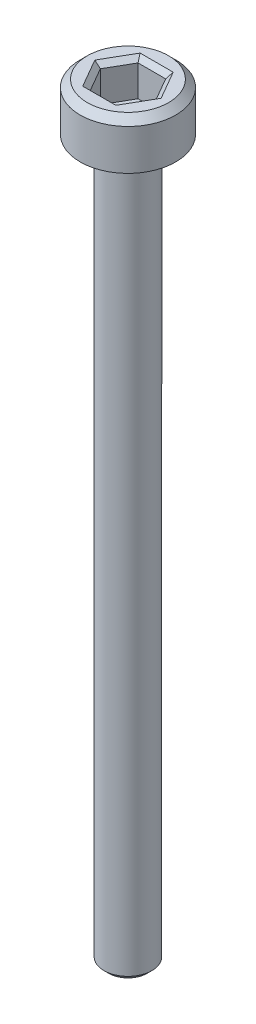
ISO-10303-21;
HEADER;
FILE_DESCRIPTION(('STEP AP214'),'2;1');
FILE_NAME('part.step','',(''),(''),'','','');
FILE_SCHEMA(('AUTOMOTIVE_DESIGN { 1 0 10303 214 1 1 1 1 }'));
ENDSEC;
DATA;
#1=APPLICATION_CONTEXT('core data for automotive mechanical design processes');
#2=APPLICATION_PROTOCOL_DEFINITION('international standard','automotive_design',2000,#1);
#3=PRODUCT_CONTEXT('',#1,'mechanical');
#4=PRODUCT('Part','Part','',(#3));
#5=PRODUCT_RELATED_PRODUCT_CATEGORY('part','',(#4));
#6=PRODUCT_DEFINITION_FORMATION('','',#4);
#7=PRODUCT_DEFINITION_CONTEXT('part definition',#1,'design');
#8=PRODUCT_DEFINITION('design','',#6,#7);
#9=PRODUCT_DEFINITION_SHAPE('','',#8);
#10=(LENGTH_UNIT() NAMED_UNIT(*) SI_UNIT(.MILLI.,.METRE.));
#11=(NAMED_UNIT(*) PLANE_ANGLE_UNIT() SI_UNIT($,.RADIAN.));
#12=(NAMED_UNIT(*) SI_UNIT($,.STERADIAN.) SOLID_ANGLE_UNIT());
#13=UNCERTAINTY_MEASURE_WITH_UNIT(LENGTH_MEASURE(1.E-05),#10,'distance_accuracy_value','');
#14=(GEOMETRIC_REPRESENTATION_CONTEXT(3) GLOBAL_UNCERTAINTY_ASSIGNED_CONTEXT((#13)) GLOBAL_UNIT_ASSIGNED_CONTEXT((#10,
#11,#12)) REPRESENTATION_CONTEXT('',''));
#15=CARTESIAN_POINT('',(0.,0.,0.));
#16=DIRECTION('',(0.,0.,1.));
#17=DIRECTION('',(1.,0.,0.));
#18=AXIS2_PLACEMENT_3D('',#15,#16,#17);
#19=CARTESIAN_POINT('',(0.,0.,0.));
#20=DIRECTION('',(0.,1.,0.));
#21=DIRECTION('',(0.,0.,1.));
#22=AXIS2_PLACEMENT_3D('',#19,#20,#21);
#23=PLANE('',#22);
#24=CARTESIAN_POINT('',(0.,0.,0.));
#25=DIRECTION('',(0.,1.,0.));
#26=DIRECTION('',(0.,0.,1.));
#27=AXIS2_PLACEMENT_3D('',#24,#25,#26);
#28=CIRCLE('',#27,2.);
#29=CARTESIAN_POINT('',(0.,0.,2.));
#30=VERTEX_POINT('',#29);
#31=EDGE_CURVE('E146',#30,#30,#28,.T.);
#32=ORIENTED_EDGE('',*,*,#31,.F.);
#33=EDGE_LOOP('',(#32));
#34=FACE_BOUND('',#33,.T.);
#35=CARTESIAN_POINT('',(0.,0.,0.));
#36=DIRECTION('',(0.,1.,0.));
#37=DIRECTION('',(0.,0.,1.));
#38=AXIS2_PLACEMENT_3D('',#35,#36,#37);
#39=CIRCLE('',#38,1.);
#40=CARTESIAN_POINT('',(0.,0.,1.));
#41=VERTEX_POINT('',#40);
#42=EDGE_CURVE('E185',#41,#41,#39,.F.);
#43=ORIENTED_EDGE('',*,*,#42,.F.);
#44=EDGE_LOOP('',(#43));
#45=FACE_BOUND('',#44,.T.);
#46=ADVANCED_FACE('F33',(#34,#45),#23,.F.);
#47=CARTESIAN_POINT('',(0.,2.,0.));
#48=DIRECTION('',(0.,-1.,0.));
#49=DIRECTION('',(0.,0.,-1.));
#50=AXIS2_PLACEMENT_3D('',#47,#48,#49);
#51=CYLINDRICAL_SURFACE('',#50,2.);
#52=CARTESIAN_POINT('',(0.,1.7,0.));
#53=DIRECTION('',(0.,1.,0.));
#54=DIRECTION('',(0.,0.,1.));
#55=AXIS2_PLACEMENT_3D('',#52,#53,#54);
#56=CIRCLE('',#55,2.);
#57=CARTESIAN_POINT('',(0.,1.7,2.));
#58=VERTEX_POINT('',#57);
#59=EDGE_CURVE('E160',#58,#58,#56,.F.);
#60=ORIENTED_EDGE('',*,*,#59,.T.);
#61=EDGE_LOOP('',(#60));
#62=FACE_BOUND('',#61,.T.);
#63=ORIENTED_EDGE('',*,*,#31,.T.);
#64=EDGE_LOOP('',(#63));
#65=FACE_BOUND('',#64,.T.);
#66=ADVANCED_FACE('F213',(#62,#65),#51,.T.);
#67=CARTESIAN_POINT('',(0.,2.,0.));
#68=DIRECTION('',(0.,1.,0.));
#69=DIRECTION('',(0.,0.,1.));
#70=AXIS2_PLACEMENT_3D('',#67,#68,#69);
#71=PLANE('',#70);
#72=DIRECTION('',(1.,0.,0.));
#73=VECTOR('',#72,1.);
#74=CARTESIAN_POINT('',(0.577350269189625,2.,-1.2));
#75=LINE('',#74,#73);
#76=CARTESIAN_POINT('',(-0.692820323027552,2.,-1.2));
#77=VERTEX_POINT('',#76);
#78=CARTESIAN_POINT('',(0.692820323027551,2.,-1.2));
#79=VERTEX_POINT('',#78);
#80=EDGE_CURVE('E165',#77,#79,#75,.T.);
#81=ORIENTED_EDGE('',*,*,#80,.T.);
#82=DIRECTION('',(0.5,0.,0.866025403784438));
#83=VECTOR('',#82,1.);
#84=CARTESIAN_POINT('',(1.32790561913614,2.,-0.100000000000001));
#85=LINE('',#84,#83);
#86=CARTESIAN_POINT('',(1.3856406460551,2.,0.));
#87=VERTEX_POINT('',#86);
#88=EDGE_CURVE('E175',#79,#87,#85,.T.);
#89=ORIENTED_EDGE('',*,*,#88,.T.);
#90=DIRECTION('',(-0.5,0.,0.866025403784439));
#91=VECTOR('',#90,1.);
#92=CARTESIAN_POINT('',(0.750555349946515,2.,1.1));
#93=LINE('',#92,#91);
#94=CARTESIAN_POINT('',(0.692820323027551,2.,1.2));
#95=VERTEX_POINT('',#94);
#96=EDGE_CURVE('E173',#87,#95,#93,.T.);
#97=ORIENTED_EDGE('',*,*,#96,.T.);
#98=DIRECTION('',(-1.,0.,0.));
#99=VECTOR('',#98,1.);
#100=CARTESIAN_POINT('',(-0.577350269189626,2.,1.2));
#101=LINE('',#100,#99);
#102=CARTESIAN_POINT('',(-0.692820323027551,2.,1.2));
#103=VERTEX_POINT('',#102);
#104=EDGE_CURVE('E171',#95,#103,#101,.T.);
#105=ORIENTED_EDGE('',*,*,#104,.T.);
#106=DIRECTION('',(-0.5,0.,-0.866025403784439));
#107=VECTOR('',#106,1.);
#108=CARTESIAN_POINT('',(-1.32790561913614,2.,0.100000000000001));
#109=LINE('',#108,#107);
#110=CARTESIAN_POINT('',(-1.3856406460551,2.,0.));
#111=VERTEX_POINT('',#110);
#112=EDGE_CURVE('E169',#103,#111,#109,.T.);
#113=ORIENTED_EDGE('',*,*,#112,.T.);
#114=DIRECTION('',(0.5,0.,-0.866025403784439));
#115=VECTOR('',#114,1.);
#116=CARTESIAN_POINT('',(-0.750555349946515,2.,-1.1));
#117=LINE('',#116,#115);
#118=EDGE_CURVE('E167',#111,#77,#117,.T.);
#119=ORIENTED_EDGE('',*,*,#118,.T.);
#120=EDGE_LOOP('',(#81,#89,#97,#105,#113,#119));
#121=FACE_BOUND('',#120,.T.);
#122=CARTESIAN_POINT('',(0.,2.,0.));
#123=DIRECTION('',(0.,1.,0.));
#124=DIRECTION('',(0.,0.,1.));
#125=AXIS2_PLACEMENT_3D('',#122,#123,#124);
#126=CIRCLE('',#125,1.7);
#127=CARTESIAN_POINT('',(0.,2.,1.7));
#128=VERTEX_POINT('',#127);
#129=EDGE_CURVE('E157',#128,#128,#126,.T.);
#130=ORIENTED_EDGE('',*,*,#129,.T.);
#131=EDGE_LOOP('',(#130));
#132=FACE_BOUND('',#131,.T.);
#133=ADVANCED_FACE('F219',(#121,#132),#71,.T.);
#134=CARTESIAN_POINT('',(0.,2.,0.));
#135=DIRECTION('',(0.,-1.,0.));
#136=DIRECTION('',(0.,0.,-1.));
#137=AXIS2_PLACEMENT_3D('',#134,#135,#136);
#138=CONICAL_SURFACE('',#137,1.7,0.785398163397447);
#139=ORIENTED_EDGE('',*,*,#59,.F.);
#140=EDGE_LOOP('',(#139));
#141=FACE_BOUND('',#140,.T.);
#142=ORIENTED_EDGE('',*,*,#129,.F.);
#143=EDGE_LOOP('',(#142));
#144=FACE_BOUND('',#143,.T.);
#145=ADVANCED_FACE('F227',(#141,#144),#138,.T.);
#146=CARTESIAN_POINT('',(0.577350269189626,0.5,1.));
#147=DIRECTION('',(0.866025403784439,0.,0.5));
#148=DIRECTION('',(0.5,0.,-0.866025403784439));
#149=AXIS2_PLACEMENT_3D('',#146,#147,#148);
#150=PLANE('',#149);
#151=DIRECTION('',(0.,1.,0.));
#152=VECTOR('',#151,1.);
#153=CARTESIAN_POINT('',(0.577350269189626,0.5,1.));
#154=LINE('',#153,#152);
#155=CARTESIAN_POINT('',(0.577350269189626,0.5,1.));
#156=VERTEX_POINT('',#155);
#157=CARTESIAN_POINT('',(0.577350269189626,1.8,1.));
#158=VERTEX_POINT('',#157);
#159=EDGE_CURVE('E144',#156,#158,#154,.T.);
#160=ORIENTED_EDGE('',*,*,#159,.T.);
#161=DIRECTION('',(0.5,0.,-0.866025403784439));
#162=VECTOR('',#161,1.);
#163=CARTESIAN_POINT('',(1.15470053837925,1.8,0.));
#164=LINE('',#163,#162);
#165=CARTESIAN_POINT('',(1.15470053837925,1.8,0.));
#166=VERTEX_POINT('',#165);
#167=EDGE_CURVE('E113',#158,#166,#164,.T.);
#168=ORIENTED_EDGE('',*,*,#167,.T.);
#169=DIRECTION('',(0.,1.,0.));
#170=VECTOR('',#169,1.);
#171=CARTESIAN_POINT('',(1.15470053837925,0.5,0.));
#172=LINE('',#171,#170);
#173=CARTESIAN_POINT('',(1.15470053837925,0.5,0.));
#174=VERTEX_POINT('',#173);
#175=EDGE_CURVE('E105',#174,#166,#172,.T.);
#176=ORIENTED_EDGE('',*,*,#175,.F.);
#177=DIRECTION('',(0.5,0.,-0.866025403784439));
#178=VECTOR('',#177,1.);
#179=CARTESIAN_POINT('',(0.577350269189626,0.5,1.));
#180=LINE('',#179,#178);
#181=EDGE_CURVE('E110',#156,#174,#180,.T.);
#182=ORIENTED_EDGE('',*,*,#181,.F.);
#183=EDGE_LOOP('',(#160,#168,#176,#182));
#184=FACE_BOUND('',#183,.T.);
#185=ADVANCED_FACE('F108',(#184),#150,.F.);
#186=CARTESIAN_POINT('',(-0.577350269189626,0.5,1.));
#187=DIRECTION('',(0.,0.,1.));
#188=DIRECTION('',(1.,0.,0.));
#189=AXIS2_PLACEMENT_3D('',#186,#187,#188);
#190=PLANE('',#189);
#191=DIRECTION('',(0.,1.,0.));
#192=VECTOR('',#191,1.);
#193=CARTESIAN_POINT('',(-0.577350269189626,0.5,1.));
#194=LINE('',#193,#192);
#195=CARTESIAN_POINT('',(-0.577350269189626,0.5,1.));
#196=VERTEX_POINT('',#195);
#197=CARTESIAN_POINT('',(-0.577350269189626,1.8,1.));
#198=VERTEX_POINT('',#197);
#199=EDGE_CURVE('E147',#196,#198,#194,.T.);
#200=ORIENTED_EDGE('',*,*,#199,.T.);
#201=DIRECTION('',(1.,0.,0.));
#202=VECTOR('',#201,1.);
#203=CARTESIAN_POINT('',(0.577350269189626,1.8,1.));
#204=LINE('',#203,#202);
#205=EDGE_CURVE('E179',#198,#158,#204,.T.);
#206=ORIENTED_EDGE('',*,*,#205,.T.);
#207=ORIENTED_EDGE('',*,*,#159,.F.);
#208=DIRECTION('',(1.,0.,0.));
#209=VECTOR('',#208,1.);
#210=CARTESIAN_POINT('',(-0.577350269189626,0.5,1.));
#211=LINE('',#210,#209);
#212=EDGE_CURVE('E118',#196,#156,#211,.T.);
#213=ORIENTED_EDGE('',*,*,#212,.F.);
#214=EDGE_LOOP('',(#200,#206,#207,#213));
#215=FACE_BOUND('',#214,.T.);
#216=ADVANCED_FACE('F280',(#215),#190,.F.);
#217=CARTESIAN_POINT('',(-1.15470053837925,0.5,0.));
#218=DIRECTION('',(-0.866025403784438,0.,0.5));
#219=DIRECTION('',(0.5,0.,0.866025403784439));
#220=AXIS2_PLACEMENT_3D('',#217,#218,#219);
#221=PLANE('',#220);
#222=DIRECTION('',(0.,1.,0.));
#223=VECTOR('',#222,1.);
#224=CARTESIAN_POINT('',(-1.15470053837925,0.5,0.));
#225=LINE('',#224,#223);
#226=CARTESIAN_POINT('',(-1.15470053837925,0.5,0.));
#227=VERTEX_POINT('',#226);
#228=CARTESIAN_POINT('',(-1.15470053837925,1.8,0.));
#229=VERTEX_POINT('',#228);
#230=EDGE_CURVE('E150',#227,#229,#225,.T.);
#231=ORIENTED_EDGE('',*,*,#230,.T.);
#232=DIRECTION('',(0.5,0.,0.866025403784439));
#233=VECTOR('',#232,1.);
#234=CARTESIAN_POINT('',(-0.577350269189626,1.8,1.));
#235=LINE('',#234,#233);
#236=EDGE_CURVE('E181',#229,#198,#235,.T.);
#237=ORIENTED_EDGE('',*,*,#236,.T.);
#238=ORIENTED_EDGE('',*,*,#199,.F.);
#239=DIRECTION('',(0.5,0.,0.866025403784439));
#240=VECTOR('',#239,1.);
#241=CARTESIAN_POINT('',(-1.15470053837925,0.5,0.));
#242=LINE('',#241,#240);
#243=EDGE_CURVE('E141',#227,#196,#242,.T.);
#244=ORIENTED_EDGE('',*,*,#243,.F.);
#245=EDGE_LOOP('',(#231,#237,#238,#244));
#246=FACE_BOUND('',#245,.T.);
#247=ADVANCED_FACE('F278',(#246),#221,.F.);
#248=CARTESIAN_POINT('',(-0.577350269189626,0.5,-1.));
#249=DIRECTION('',(-0.866025403784439,0.,-0.5));
#250=DIRECTION('',(-0.5,0.,0.866025403784439));
#251=AXIS2_PLACEMENT_3D('',#248,#249,#250);
#252=PLANE('',#251);
#253=DIRECTION('',(0.,1.,0.));
#254=VECTOR('',#253,1.);
#255=CARTESIAN_POINT('',(-0.577350269189626,0.5,-1.));
#256=LINE('',#255,#254);
#257=CARTESIAN_POINT('',(-0.577350269189626,0.5,-1.));
#258=VERTEX_POINT('',#257);
#259=CARTESIAN_POINT('',(-0.577350269189626,1.8,-1.));
#260=VERTEX_POINT('',#259);
#261=EDGE_CURVE('E152',#258,#260,#256,.T.);
#262=ORIENTED_EDGE('',*,*,#261,.T.);
#263=DIRECTION('',(-0.5,0.,0.866025403784439));
#264=VECTOR('',#263,1.);
#265=CARTESIAN_POINT('',(-1.15470053837925,1.8,0.));
#266=LINE('',#265,#264);
#267=EDGE_CURVE('E55',#260,#229,#266,.T.);
#268=ORIENTED_EDGE('',*,*,#267,.T.);
#269=ORIENTED_EDGE('',*,*,#230,.F.);
#270=DIRECTION('',(-0.5,0.,0.866025403784439));
#271=VECTOR('',#270,1.);
#272=CARTESIAN_POINT('',(-0.577350269189626,0.5,-1.));
#273=LINE('',#272,#271);
#274=EDGE_CURVE('E138',#258,#227,#273,.T.);
#275=ORIENTED_EDGE('',*,*,#274,.F.);
#276=EDGE_LOOP('',(#262,#268,#269,#275));
#277=FACE_BOUND('',#276,.T.);
#278=ADVANCED_FACE('F276',(#277),#252,.F.);
#279=CARTESIAN_POINT('',(0.577350269189625,0.5,-1.));
#280=DIRECTION('',(0.,0.,-1.));
#281=DIRECTION('',(-1.,0.,0.));
#282=AXIS2_PLACEMENT_3D('',#279,#280,#281);
#283=PLANE('',#282);
#284=DIRECTION('',(0.,1.,0.));
#285=VECTOR('',#284,1.);
#286=CARTESIAN_POINT('',(0.577350269189625,0.5,-1.));
#287=LINE('',#286,#285);
#288=CARTESIAN_POINT('',(0.577350269189625,0.5,-1.));
#289=VERTEX_POINT('',#288);
#290=CARTESIAN_POINT('',(0.577350269189625,1.8,-1.));
#291=VERTEX_POINT('',#290);
#292=EDGE_CURVE('E117',#289,#291,#287,.T.);
#293=ORIENTED_EDGE('',*,*,#292,.T.);
#294=DIRECTION('',(-1.,0.,0.));
#295=VECTOR('',#294,1.);
#296=CARTESIAN_POINT('',(-0.577350269189626,1.8,-1.));
#297=LINE('',#296,#295);
#298=EDGE_CURVE('E48',#291,#260,#297,.T.);
#299=ORIENTED_EDGE('',*,*,#298,.T.);
#300=ORIENTED_EDGE('',*,*,#261,.F.);
#301=DIRECTION('',(-1.,0.,0.));
#302=VECTOR('',#301,1.);
#303=CARTESIAN_POINT('',(0.577350269189625,0.5,-1.));
#304=LINE('',#303,#302);
#305=EDGE_CURVE('E126',#289,#258,#304,.T.);
#306=ORIENTED_EDGE('',*,*,#305,.F.);
#307=EDGE_LOOP('',(#293,#299,#300,#306));
#308=FACE_BOUND('',#307,.T.);
#309=ADVANCED_FACE('F273',(#308),#283,.F.);
#310=CARTESIAN_POINT('',(1.15470053837925,0.5,0.));
#311=DIRECTION('',(0.866025403784438,0.,-0.5));
#312=DIRECTION('',(-0.5,0.,-0.866025403784439));
#313=AXIS2_PLACEMENT_3D('',#310,#311,#312);
#314=PLANE('',#313);
#315=ORIENTED_EDGE('',*,*,#175,.T.);
#316=DIRECTION('',(-0.5,0.,-0.866025403784439));
#317=VECTOR('',#316,1.);
#318=CARTESIAN_POINT('',(0.577350269189625,1.8,-1.));
#319=LINE('',#318,#317);
#320=EDGE_CURVE('E163',#166,#291,#319,.T.);
#321=ORIENTED_EDGE('',*,*,#320,.T.);
#322=ORIENTED_EDGE('',*,*,#292,.F.);
#323=DIRECTION('',(-0.5,0.,-0.866025403784438));
#324=VECTOR('',#323,1.);
#325=CARTESIAN_POINT('',(1.15470053837925,0.5,0.));
#326=LINE('',#325,#324);
#327=EDGE_CURVE('E121',#174,#289,#326,.T.);
#328=ORIENTED_EDGE('',*,*,#327,.F.);
#329=EDGE_LOOP('',(#315,#321,#322,#328));
#330=FACE_BOUND('',#329,.T.);
#331=ADVANCED_FACE('F122',(#330),#314,.F.);
#332=CARTESIAN_POINT('',(0.,0.5,0.));
#333=DIRECTION('',(0.,1.,0.));
#334=DIRECTION('',(0.,0.,1.));
#335=AXIS2_PLACEMENT_3D('',#332,#333,#334);
#336=PLANE('',#335);
#337=ORIENTED_EDGE('',*,*,#181,.T.);
#338=ORIENTED_EDGE('',*,*,#327,.T.);
#339=ORIENTED_EDGE('',*,*,#305,.T.);
#340=ORIENTED_EDGE('',*,*,#274,.T.);
#341=ORIENTED_EDGE('',*,*,#243,.T.);
#342=ORIENTED_EDGE('',*,*,#212,.T.);
#343=EDGE_LOOP('',(#337,#338,#339,#340,#341,#342));
#344=FACE_BOUND('',#343,.T.);
#345=ADVANCED_FACE('F128',(#344),#336,.T.);
#346=CARTESIAN_POINT('',(-1.15470053837925,1.8,0.));
#347=DIRECTION('',(0.612372435695792,0.70710678118655,-0.353553390593273));
#348=DIRECTION('',(-0.5,0.,-0.866025403784439));
#349=AXIS2_PLACEMENT_3D('',#346,#347,#348);
#350=PLANE('',#349);
#351=DIRECTION('',(0.755928946018457,-0.654653670707974,0.));
#352=VECTOR('',#351,1.);
#353=CARTESIAN_POINT('',(-1.15470053837925,1.8,0.));
#354=LINE('',#353,#352);
#355=EDGE_CURVE('E134',#111,#229,#354,.T.);
#356=ORIENTED_EDGE('',*,*,#355,.F.);
#357=ORIENTED_EDGE('',*,*,#112,.F.);
#358=DIRECTION('',(0.377964473009227,-0.654653670707974,-0.654653670707981));
#359=VECTOR('',#358,1.);
#360=CARTESIAN_POINT('',(-0.577350269189626,1.8,1.));
#361=LINE('',#360,#359);
#362=EDGE_CURVE('E131',#198,#103,#361,.F.);
#363=ORIENTED_EDGE('',*,*,#362,.F.);
#364=ORIENTED_EDGE('',*,*,#236,.F.);
#365=EDGE_LOOP('',(#356,#357,#363,#364));
#366=FACE_BOUND('',#365,.T.);
#367=ADVANCED_FACE('F249',(#366),#350,.T.);
#368=CARTESIAN_POINT('',(-0.577350269189626,1.8,1.));
#369=DIRECTION('',(0.,0.707106781186551,-0.707106781186544));
#370=DIRECTION('',(-1.,0.,0.));
#371=AXIS2_PLACEMENT_3D('',#368,#369,#370);
#372=PLANE('',#371);
#373=ORIENTED_EDGE('',*,*,#362,.T.);
#374=ORIENTED_EDGE('',*,*,#104,.F.);
#375=DIRECTION('',(-0.377964473009228,-0.654653670707974,-0.654653670707981));
#376=VECTOR('',#375,1.);
#377=CARTESIAN_POINT('',(0.577350269189626,1.8,1.));
#378=LINE('',#377,#376);
#379=EDGE_CURVE('E193',#158,#95,#378,.F.);
#380=ORIENTED_EDGE('',*,*,#379,.F.);
#381=ORIENTED_EDGE('',*,*,#205,.F.);
#382=EDGE_LOOP('',(#373,#374,#380,#381));
#383=FACE_BOUND('',#382,.T.);
#384=ADVANCED_FACE('F246',(#383),#372,.T.);
#385=CARTESIAN_POINT('',(-0.577350269189626,1.8,-1.));
#386=DIRECTION('',(0.612372435695792,0.70710678118655,0.353553390593272));
#387=DIRECTION('',(0.5,0.,-0.866025403784439));
#388=AXIS2_PLACEMENT_3D('',#385,#386,#387);
#389=PLANE('',#388);
#390=ORIENTED_EDGE('',*,*,#355,.T.);
#391=ORIENTED_EDGE('',*,*,#267,.F.);
#392=DIRECTION('',(0.377964473009228,-0.654653670707974,0.65465367070798));
#393=VECTOR('',#392,1.);
#394=CARTESIAN_POINT('',(-0.577350269189626,1.8,-1.));
#395=LINE('',#394,#393);
#396=EDGE_CURVE('E190',#77,#260,#395,.T.);
#397=ORIENTED_EDGE('',*,*,#396,.F.);
#398=ORIENTED_EDGE('',*,*,#118,.F.);
#399=EDGE_LOOP('',(#390,#391,#397,#398));
#400=FACE_BOUND('',#399,.T.);
#401=ADVANCED_FACE('F242',(#400),#389,.T.);
#402=CARTESIAN_POINT('',(0.577350269189626,1.8,1.));
#403=DIRECTION('',(-0.612372435695792,0.70710678118655,-0.353553390593272));
#404=DIRECTION('',(-0.5,0.,0.866025403784439));
#405=AXIS2_PLACEMENT_3D('',#402,#403,#404);
#406=PLANE('',#405);
#407=ORIENTED_EDGE('',*,*,#379,.T.);
#408=ORIENTED_EDGE('',*,*,#96,.F.);
#409=DIRECTION('',(-0.755928946018457,-0.654653670707974,0.));
#410=VECTOR('',#409,1.);
#411=CARTESIAN_POINT('',(1.15470053837925,1.8,0.));
#412=LINE('',#411,#410);
#413=EDGE_CURVE('E188',#166,#87,#412,.F.);
#414=ORIENTED_EDGE('',*,*,#413,.F.);
#415=ORIENTED_EDGE('',*,*,#167,.F.);
#416=EDGE_LOOP('',(#407,#408,#414,#415));
#417=FACE_BOUND('',#416,.T.);
#418=ADVANCED_FACE('F238',(#417),#406,.T.);
#419=CARTESIAN_POINT('',(0.577350269189625,1.8,-1.));
#420=DIRECTION('',(0.,0.707106781186551,0.707106781186544));
#421=DIRECTION('',(1.,0.,0.));
#422=AXIS2_PLACEMENT_3D('',#419,#420,#421);
#423=PLANE('',#422);
#424=ORIENTED_EDGE('',*,*,#396,.T.);
#425=ORIENTED_EDGE('',*,*,#298,.F.);
#426=DIRECTION('',(0.377964473009229,0.654653670707974,-0.65465367070798));
#427=VECTOR('',#426,1.);
#428=CARTESIAN_POINT('',(0.41239304942116,1.51428571428571,-0.714285714285713));
#429=LINE('',#428,#427);
#430=EDGE_CURVE('E186',#79,#291,#429,.F.);
#431=ORIENTED_EDGE('',*,*,#430,.F.);
#432=ORIENTED_EDGE('',*,*,#80,.F.);
#433=EDGE_LOOP('',(#424,#425,#431,#432));
#434=FACE_BOUND('',#433,.T.);
#435=ADVANCED_FACE('F234',(#434),#423,.T.);
#436=CARTESIAN_POINT('',(1.15470053837925,1.8,0.));
#437=DIRECTION('',(-0.612372435695792,0.707106781186551,0.353553390593272));
#438=DIRECTION('',(0.5,0.,0.866025403784439));
#439=AXIS2_PLACEMENT_3D('',#436,#437,#438);
#440=PLANE('',#439);
#441=ORIENTED_EDGE('',*,*,#413,.T.);
#442=ORIENTED_EDGE('',*,*,#88,.F.);
#443=ORIENTED_EDGE('',*,*,#430,.T.);
#444=ORIENTED_EDGE('',*,*,#320,.F.);
#445=EDGE_LOOP('',(#441,#442,#443,#444));
#446=FACE_BOUND('',#445,.T.);
#447=ADVANCED_FACE('F231',(#446),#440,.T.);
#448=CARTESIAN_POINT('',(0.,-30.,0.));
#449=DIRECTION('',(0.,1.,0.));
#450=DIRECTION('',(0.,0.,1.));
#451=AXIS2_PLACEMENT_3D('',#448,#449,#450);
#452=CYLINDRICAL_SURFACE('',#451,1.);
#453=CARTESIAN_POINT('',(0.,-29.8,0.));
#454=DIRECTION('',(0.,-1.,0.));
#455=DIRECTION('',(0.,0.,-1.));
#456=AXIS2_PLACEMENT_3D('',#453,#454,#455);
#457=CIRCLE('',#456,1.);
#458=CARTESIAN_POINT('',(0.,-29.8,-1.));
#459=VERTEX_POINT('',#458);
#460=EDGE_CURVE('E11',#459,#459,#457,.F.);
#461=ORIENTED_EDGE('',*,*,#460,.T.);
#462=EDGE_LOOP('',(#461));
#463=FACE_BOUND('',#462,.T.);
#464=ORIENTED_EDGE('',*,*,#42,.T.);
#465=EDGE_LOOP('',(#464));
#466=FACE_BOUND('',#465,.T.);
#467=ADVANCED_FACE('F209',(#463,#466),#452,.T.);
#468=CARTESIAN_POINT('',(0.,-30.,0.));
#469=DIRECTION('',(0.,-1.,0.));
#470=DIRECTION('',(0.,0.,-1.));
#471=AXIS2_PLACEMENT_3D('',#468,#469,#470);
#472=PLANE('',#471);
#473=CARTESIAN_POINT('',(0.,-30.,0.));
#474=DIRECTION('',(0.,-1.,0.));
#475=DIRECTION('',(0.,0.,-1.));
#476=AXIS2_PLACEMENT_3D('',#473,#474,#475);
#477=CIRCLE('',#476,0.800000000000009);
#478=CARTESIAN_POINT('',(0.,-30.,-0.800000000000009));
#479=VERTEX_POINT('',#478);
#480=EDGE_CURVE('E41',#479,#479,#477,.T.);
#481=ORIENTED_EDGE('',*,*,#480,.T.);
#482=EDGE_LOOP('',(#481));
#483=FACE_BOUND('',#482,.T.);
#484=ADVANCED_FACE('F202',(#483),#472,.T.);
#485=CARTESIAN_POINT('',(0.,-30.,0.));
#486=DIRECTION('',(0.,1.,0.));
#487=DIRECTION('',(0.,0.,1.));
#488=AXIS2_PLACEMENT_3D('',#485,#486,#487);
#489=CONICAL_SURFACE('',#488,0.800000000000009,0.785398163397446);
#490=ORIENTED_EDGE('',*,*,#460,.F.);
#491=EDGE_LOOP('',(#490));
#492=FACE_BOUND('',#491,.T.);
#493=ORIENTED_EDGE('',*,*,#480,.F.);
#494=EDGE_LOOP('',(#493));
#495=FACE_BOUND('',#494,.T.);
#496=ADVANCED_FACE('F35',(#492,#495),#489,.T.);
#497=CLOSED_SHELL('',(#46,#66,#133,#145,#185,#216,#247,#278,#309,#331,#345,#367,#384,#401,#418,
#435,#447,#467,#484,#496));
#498=MANIFOLD_SOLID_BREP('B2',#497);
#499=ADVANCED_BREP_SHAPE_REPRESENTATION('',(#18,#498),#14);
#500=SHAPE_DEFINITION_REPRESENTATION(#9,#499);
ENDSEC;
END-ISO-10303-21;
